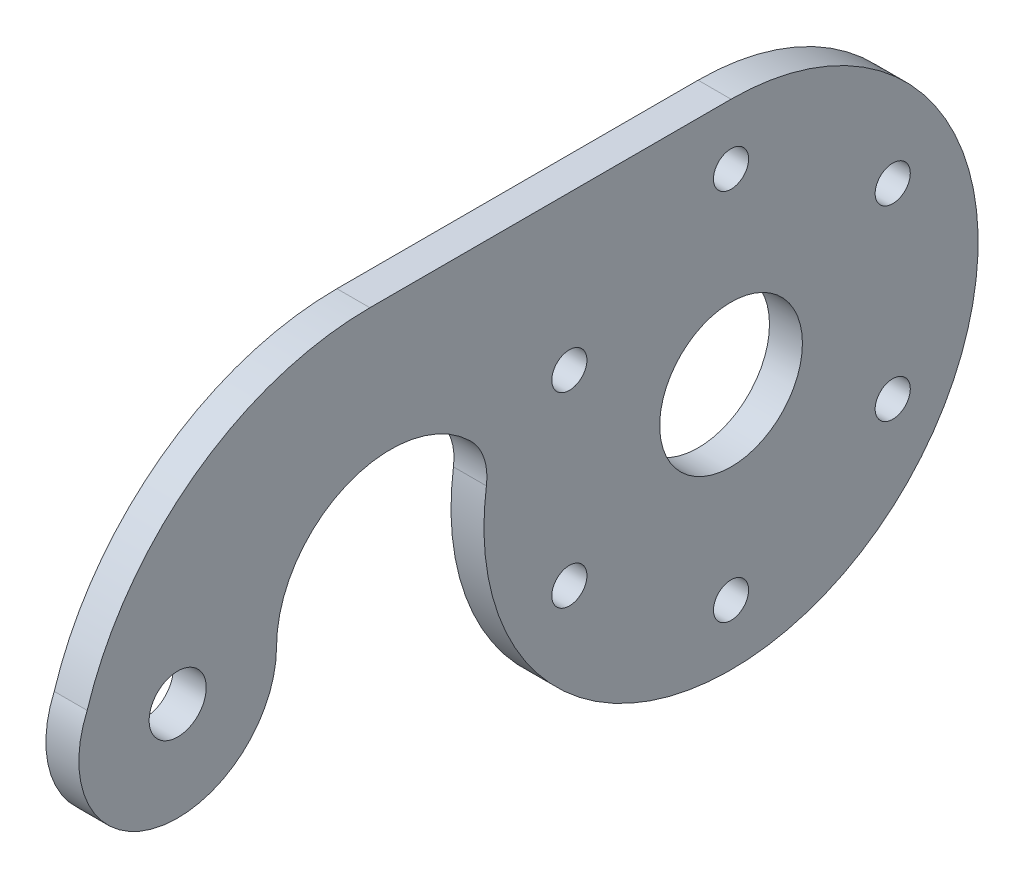
ISO-10303-21;
HEADER;
FILE_DESCRIPTION(('STEP AP214'),'2;1');
FILE_NAME('part.step','',(''),(''),'','','');
FILE_SCHEMA(('AUTOMOTIVE_DESIGN { 1 0 10303 214 1 1 1 1 }'));
ENDSEC;
DATA;
#1=APPLICATION_CONTEXT('core data for automotive mechanical design processes');
#2=APPLICATION_PROTOCOL_DEFINITION('international standard','automotive_design',2000,#1);
#3=PRODUCT_CONTEXT('',#1,'mechanical');
#4=PRODUCT('Part','Part','',(#3));
#5=PRODUCT_RELATED_PRODUCT_CATEGORY('part','',(#4));
#6=PRODUCT_DEFINITION_FORMATION('','',#4);
#7=PRODUCT_DEFINITION_CONTEXT('part definition',#1,'design');
#8=PRODUCT_DEFINITION('design','',#6,#7);
#9=PRODUCT_DEFINITION_SHAPE('','',#8);
#10=(LENGTH_UNIT() NAMED_UNIT(*) SI_UNIT(.MILLI.,.METRE.));
#11=(NAMED_UNIT(*) PLANE_ANGLE_UNIT() SI_UNIT($,.RADIAN.));
#12=(NAMED_UNIT(*) SI_UNIT($,.STERADIAN.) SOLID_ANGLE_UNIT());
#13=UNCERTAINTY_MEASURE_WITH_UNIT(LENGTH_MEASURE(1.E-05),#10,'distance_accuracy_value','');
#14=(GEOMETRIC_REPRESENTATION_CONTEXT(3) GLOBAL_UNCERTAINTY_ASSIGNED_CONTEXT((#13)) GLOBAL_UNIT_ASSIGNED_CONTEXT((#10,
#11,#12)) REPRESENTATION_CONTEXT('',''));
#15=CARTESIAN_POINT('',(0.,0.,0.));
#16=DIRECTION('',(0.,0.,1.));
#17=DIRECTION('',(1.,0.,0.));
#18=AXIS2_PLACEMENT_3D('',#15,#16,#17);
#19=CARTESIAN_POINT('',(0.,0.,0.));
#20=DIRECTION('',(1.,0.,0.));
#21=DIRECTION('',(0.,0.,-1.));
#22=AXIS2_PLACEMENT_3D('',#19,#20,#21);
#23=PLANE('',#22);
#24=CARTESIAN_POINT('',(0.,8.49999999999915,14.722431864335));
#25=DIRECTION('',(1.,0.,0.));
#26=DIRECTION('',(0.,0.,-1.));
#27=AXIS2_PLACEMENT_3D('',#24,#25,#26);
#28=CIRCLE('',#27,1.60000000000091);
#29=CARTESIAN_POINT('',(0.,8.49999999999915,13.1224318643341));
#30=VERTEX_POINT('',#29);
#31=EDGE_CURVE('E193',#30,#30,#28,.T.);
#32=ORIENTED_EDGE('',*,*,#31,.T.);
#33=EDGE_LOOP('',(#32));
#34=FACE_BOUND('',#33,.T.);
#35=CARTESIAN_POINT('',(0.,-8.50000000000084,14.722431864334));
#36=DIRECTION('',(1.,0.,0.));
#37=DIRECTION('',(0.,0.,-1.));
#38=AXIS2_PLACEMENT_3D('',#35,#36,#37);
#39=CIRCLE('',#38,1.60000000000178);
#40=CARTESIAN_POINT('',(0.,-8.50000000000084,13.1224318643322));
#41=VERTEX_POINT('',#40);
#42=EDGE_CURVE('E199',#41,#41,#39,.T.);
#43=ORIENTED_EDGE('',*,*,#42,.T.);
#44=EDGE_LOOP('',(#43));
#45=FACE_BOUND('',#44,.T.);
#46=CARTESIAN_POINT('',(0.,-17.,-1.92851244215037E-12));
#47=DIRECTION('',(1.,0.,0.));
#48=DIRECTION('',(0.,0.,-1.));
#49=AXIS2_PLACEMENT_3D('',#46,#47,#48);
#50=CIRCLE('',#49,1.60000000000196);
#51=CARTESIAN_POINT('',(0.,-17.,-1.60000000000389));
#52=VERTEX_POINT('',#51);
#53=EDGE_CURVE('E205',#52,#52,#50,.T.);
#54=ORIENTED_EDGE('',*,*,#53,.T.);
#55=EDGE_LOOP('',(#54));
#56=FACE_BOUND('',#55,.T.);
#57=CARTESIAN_POINT('',(0.,-8.49999999999916,-14.7224318643369));
#58=DIRECTION('',(1.,0.,0.));
#59=DIRECTION('',(0.,0.,-1.));
#60=AXIS2_PLACEMENT_3D('',#57,#58,#59);
#61=CIRCLE('',#60,1.60000000000122);
#62=CARTESIAN_POINT('',(0.,-8.49999999999916,-16.3224318643381));
#63=VERTEX_POINT('',#62);
#64=EDGE_CURVE('E176',#63,#63,#61,.T.);
#65=ORIENTED_EDGE('',*,*,#64,.T.);
#66=EDGE_LOOP('',(#65));
#67=FACE_BOUND('',#66,.T.);
#68=CARTESIAN_POINT('',(0.,8.50000000000084,-14.7224318643359));
#69=DIRECTION('',(1.,0.,0.));
#70=DIRECTION('',(0.,0.,-1.));
#71=AXIS2_PLACEMENT_3D('',#68,#69,#70);
#72=CIRCLE('',#71,1.60000000000026);
#73=CARTESIAN_POINT('',(0.,8.50000000000084,-16.3224318643362));
#74=VERTEX_POINT('',#73);
#75=EDGE_CURVE('E175',#74,#74,#72,.T.);
#76=ORIENTED_EDGE('',*,*,#75,.T.);
#77=EDGE_LOOP('',(#76));
#78=FACE_BOUND('',#77,.T.);
#79=CARTESIAN_POINT('',(0.,17.,0.));
#80=DIRECTION('',(1.,0.,0.));
#81=DIRECTION('',(0.,0.,-1.));
#82=AXIS2_PLACEMENT_3D('',#79,#80,#81);
#83=CIRCLE('',#82,1.6);
#84=CARTESIAN_POINT('',(0.,17.,-1.6));
#85=VERTEX_POINT('',#84);
#86=EDGE_CURVE('E182',#85,#85,#83,.T.);
#87=ORIENTED_EDGE('',*,*,#86,.T.);
#88=EDGE_LOOP('',(#87));
#89=FACE_BOUND('',#88,.T.);
#90=CARTESIAN_POINT('',(0.,0.,50.3866243253377));
#91=DIRECTION('',(1.,0.,0.));
#92=DIRECTION('',(0.,0.,-1.));
#93=AXIS2_PLACEMENT_3D('',#90,#91,#92);
#94=CIRCLE('',#93,2.6);
#95=CARTESIAN_POINT('',(0.,0.,47.7866243253377));
#96=VERTEX_POINT('',#95);
#97=EDGE_CURVE('E169',#96,#96,#94,.T.);
#98=ORIENTED_EDGE('',*,*,#97,.T.);
#99=EDGE_LOOP('',(#98));
#100=FACE_BOUND('',#99,.T.);
#101=CARTESIAN_POINT('',(0.,0.,0.));
#102=DIRECTION('',(1.,0.,0.));
#103=DIRECTION('',(0.,0.,-1.));
#104=AXIS2_PLACEMENT_3D('',#101,#102,#103);
#105=CIRCLE('',#104,6.5);
#106=CARTESIAN_POINT('',(0.,0.,-6.5));
#107=VERTEX_POINT('',#106);
#108=EDGE_CURVE('E139',#107,#107,#105,.T.);
#109=ORIENTED_EDGE('',*,*,#108,.T.);
#110=EDGE_LOOP('',(#109));
#111=FACE_BOUND('',#110,.T.);
#112=CARTESIAN_POINT('',(0.,0.,0.));
#113=DIRECTION('',(1.,0.,0.));
#114=DIRECTION('',(0.,0.,-1.));
#115=AXIS2_PLACEMENT_3D('',#112,#113,#114);
#116=CIRCLE('',#115,22.5);
#117=CARTESIAN_POINT('',(0.,3.1475756942727,22.2787514741923));
#118=VERTEX_POINT('',#117);
#119=CARTESIAN_POINT('',(0.,22.5,0.));
#120=VERTEX_POINT('',#119);
#121=EDGE_CURVE('E119',#118,#120,#116,.T.);
#122=ORIENTED_EDGE('',*,*,#121,.F.);
#123=CARTESIAN_POINT('',(0.,3.84703695966663,27.2295851351239));
#124=DIRECTION('',(1.,0.,0.));
#125=DIRECTION('',(0.,0.,-1.));
#126=AXIS2_PLACEMENT_3D('',#123,#124,#125);
#127=CIRCLE('',#126,5.);
#128=CARTESIAN_POINT('',(0.,7.41795329549767,23.7297913522711));
#129=VERTEX_POINT('',#128);
#130=EDGE_CURVE('E61',#118,#129,#127,.T.);
#131=ORIENTED_EDGE('',*,*,#130,.T.);
#132=CARTESIAN_POINT('',(0.,0.,31.));
#133=DIRECTION('',(1.,0.,0.));
#134=DIRECTION('',(0.,0.,-1.));
#135=AXIS2_PLACEMENT_3D('',#132,#133,#134);
#136=CIRCLE('',#135,10.3866243253377);
#137=CARTESIAN_POINT('',(0.,0.,41.3866243253377));
#138=VERTEX_POINT('',#137);
#139=EDGE_CURVE('E137',#129,#138,#136,.T.);
#140=ORIENTED_EDGE('',*,*,#139,.T.);
#141=CARTESIAN_POINT('',(0.,0.,50.3866243253377));
#142=DIRECTION('',(1.,0.,0.));
#143=DIRECTION('',(0.,0.,-1.));
#144=AXIS2_PLACEMENT_3D('',#141,#142,#143);
#145=CIRCLE('',#144,9.);
#146=CARTESIAN_POINT('',(0.,3.61408669201935,58.6290983096806));
#147=VERTEX_POINT('',#146);
#148=EDGE_CURVE('E146',#147,#138,#145,.T.);
#149=ORIENTED_EDGE('',*,*,#148,.F.);
#150=CARTESIAN_POINT('',(0.,-4.48711657964616,32.8866243253377));
#151=DIRECTION('',(1.,0.,0.));
#152=DIRECTION('',(0.,0.,-1.));
#153=AXIS2_PLACEMENT_3D('',#150,#151,#152);
#154=CIRCLE('',#153,26.9871165796462);
#155=CARTESIAN_POINT('',(0.,22.5,32.8866243253377));
#156=VERTEX_POINT('',#155);
#157=EDGE_CURVE('E143',#147,#156,#154,.F.);
#158=ORIENTED_EDGE('',*,*,#157,.T.);
#159=DIRECTION('',(0.,0.,1.));
#160=VECTOR('',#159,1.);
#161=CARTESIAN_POINT('',(0.,22.5,0.));
#162=LINE('',#161,#160);
#163=EDGE_CURVE('E141',#120,#156,#162,.T.);
#164=ORIENTED_EDGE('',*,*,#163,.F.);
#165=EDGE_LOOP('',(#122,#131,#140,#149,#158,#164));
#166=FACE_BOUND('',#165,.T.);
#167=ADVANCED_FACE('F53',(#34,#45,#56,#67,#78,#89,#100,#111,#166),#23,.F.);
#168=CARTESIAN_POINT('',(3.,0.,0.));
#169=DIRECTION('',(-1.,0.,0.));
#170=DIRECTION('',(0.,0.,1.));
#171=AXIS2_PLACEMENT_3D('',#168,#169,#170);
#172=CYLINDRICAL_SURFACE('',#171,22.5);
#173=CARTESIAN_POINT('',(3.,0.,0.));
#174=DIRECTION('',(1.,0.,0.));
#175=DIRECTION('',(0.,0.,-1.));
#176=AXIS2_PLACEMENT_3D('',#173,#174,#175);
#177=CIRCLE('',#176,22.5);
#178=CARTESIAN_POINT('',(3.,3.1475756942727,22.2787514741923));
#179=VERTEX_POINT('',#178);
#180=CARTESIAN_POINT('',(3.,22.5,0.));
#181=VERTEX_POINT('',#180);
#182=EDGE_CURVE('E103',#179,#181,#177,.T.);
#183=ORIENTED_EDGE('',*,*,#182,.F.);
#184=DIRECTION('',(-1.,0.,0.));
#185=VECTOR('',#184,1.);
#186=CARTESIAN_POINT('',(3.,3.1475756942727,22.2787514741923));
#187=LINE('',#186,#185);
#188=EDGE_CURVE('E123',#179,#118,#187,.T.);
#189=ORIENTED_EDGE('',*,*,#188,.T.);
#190=ORIENTED_EDGE('',*,*,#121,.T.);
#191=DIRECTION('',(-1.,0.,0.));
#192=VECTOR('',#191,1.);
#193=CARTESIAN_POINT('',(3.,22.5,0.));
#194=LINE('',#193,#192);
#195=EDGE_CURVE('E117',#181,#120,#194,.T.);
#196=ORIENTED_EDGE('',*,*,#195,.F.);
#197=EDGE_LOOP('',(#183,#189,#190,#196));
#198=FACE_BOUND('',#197,.T.);
#199=ADVANCED_FACE('F118',(#198),#172,.T.);
#200=CARTESIAN_POINT('',(3.,0.,0.));
#201=DIRECTION('',(1.,0.,0.));
#202=DIRECTION('',(0.,0.,-1.));
#203=AXIS2_PLACEMENT_3D('',#200,#201,#202);
#204=PLANE('',#203);
#205=CARTESIAN_POINT('',(3.,8.49999999999915,14.722431864335));
#206=DIRECTION('',(1.,0.,0.));
#207=DIRECTION('',(0.,0.,-1.));
#208=AXIS2_PLACEMENT_3D('',#205,#206,#207);
#209=CIRCLE('',#208,1.60000000000091);
#210=CARTESIAN_POINT('',(3.,8.49999999999915,13.1224318643341));
#211=VERTEX_POINT('',#210);
#212=EDGE_CURVE('E190',#211,#211,#209,.T.);
#213=ORIENTED_EDGE('',*,*,#212,.F.);
#214=EDGE_LOOP('',(#213));
#215=FACE_BOUND('',#214,.T.);
#216=CARTESIAN_POINT('',(3.,-8.50000000000084,14.722431864334));
#217=DIRECTION('',(1.,0.,0.));
#218=DIRECTION('',(0.,0.,-1.));
#219=AXIS2_PLACEMENT_3D('',#216,#217,#218);
#220=CIRCLE('',#219,1.60000000000178);
#221=CARTESIAN_POINT('',(3.,-8.50000000000084,13.1224318643322));
#222=VERTEX_POINT('',#221);
#223=EDGE_CURVE('E196',#222,#222,#220,.T.);
#224=ORIENTED_EDGE('',*,*,#223,.F.);
#225=EDGE_LOOP('',(#224));
#226=FACE_BOUND('',#225,.T.);
#227=CARTESIAN_POINT('',(3.,-17.,-1.92851244215037E-12));
#228=DIRECTION('',(1.,0.,0.));
#229=DIRECTION('',(0.,0.,-1.));
#230=AXIS2_PLACEMENT_3D('',#227,#228,#229);
#231=CIRCLE('',#230,1.60000000000196);
#232=CARTESIAN_POINT('',(3.,-17.,-1.60000000000389));
#233=VERTEX_POINT('',#232);
#234=EDGE_CURVE('E202',#233,#233,#231,.T.);
#235=ORIENTED_EDGE('',*,*,#234,.F.);
#236=EDGE_LOOP('',(#235));
#237=FACE_BOUND('',#236,.T.);
#238=CARTESIAN_POINT('',(3.,-8.49999999999916,-14.7224318643369));
#239=DIRECTION('',(1.,0.,0.));
#240=DIRECTION('',(0.,0.,-1.));
#241=AXIS2_PLACEMENT_3D('',#238,#239,#240);
#242=CIRCLE('',#241,1.60000000000122);
#243=CARTESIAN_POINT('',(3.,-8.49999999999916,-16.3224318643381));
#244=VERTEX_POINT('',#243);
#245=EDGE_CURVE('E208',#244,#244,#242,.T.);
#246=ORIENTED_EDGE('',*,*,#245,.F.);
#247=EDGE_LOOP('',(#246));
#248=FACE_BOUND('',#247,.T.);
#249=CARTESIAN_POINT('',(3.,8.50000000000084,-14.7224318643359));
#250=DIRECTION('',(1.,0.,0.));
#251=DIRECTION('',(0.,0.,-1.));
#252=AXIS2_PLACEMENT_3D('',#249,#250,#251);
#253=CIRCLE('',#252,1.60000000000026);
#254=CARTESIAN_POINT('',(3.,8.50000000000084,-16.3224318643362));
#255=VERTEX_POINT('',#254);
#256=EDGE_CURVE('E172',#255,#255,#253,.T.);
#257=ORIENTED_EDGE('',*,*,#256,.F.);
#258=EDGE_LOOP('',(#257));
#259=FACE_BOUND('',#258,.T.);
#260=CARTESIAN_POINT('',(3.,17.,0.));
#261=DIRECTION('',(1.,0.,0.));
#262=DIRECTION('',(0.,0.,-1.));
#263=AXIS2_PLACEMENT_3D('',#260,#261,#262);
#264=CIRCLE('',#263,1.6);
#265=CARTESIAN_POINT('',(3.,17.,-1.6));
#266=VERTEX_POINT('',#265);
#267=EDGE_CURVE('E179',#266,#266,#264,.T.);
#268=ORIENTED_EDGE('',*,*,#267,.F.);
#269=EDGE_LOOP('',(#268));
#270=FACE_BOUND('',#269,.T.);
#271=CARTESIAN_POINT('',(3.,0.,50.3866243253377));
#272=DIRECTION('',(1.,0.,0.));
#273=DIRECTION('',(0.,0.,-1.));
#274=AXIS2_PLACEMENT_3D('',#271,#272,#273);
#275=CIRCLE('',#274,2.6);
#276=CARTESIAN_POINT('',(3.,0.,47.7866243253377));
#277=VERTEX_POINT('',#276);
#278=EDGE_CURVE('E185',#277,#277,#275,.T.);
#279=ORIENTED_EDGE('',*,*,#278,.F.);
#280=EDGE_LOOP('',(#279));
#281=FACE_BOUND('',#280,.T.);
#282=CARTESIAN_POINT('',(3.,0.,0.));
#283=DIRECTION('',(1.,0.,0.));
#284=DIRECTION('',(0.,0.,-1.));
#285=AXIS2_PLACEMENT_3D('',#282,#283,#284);
#286=CIRCLE('',#285,6.5);
#287=CARTESIAN_POINT('',(3.,0.,-6.5));
#288=VERTEX_POINT('',#287);
#289=EDGE_CURVE('E166',#288,#288,#286,.T.);
#290=ORIENTED_EDGE('',*,*,#289,.F.);
#291=EDGE_LOOP('',(#290));
#292=FACE_BOUND('',#291,.T.);
#293=CARTESIAN_POINT('',(3.,0.,31.));
#294=DIRECTION('',(1.,0.,0.));
#295=DIRECTION('',(0.,0.,-1.));
#296=AXIS2_PLACEMENT_3D('',#293,#294,#295);
#297=CIRCLE('',#296,10.3866243253377);
#298=CARTESIAN_POINT('',(3.,7.41795329549767,23.7297913522711));
#299=VERTEX_POINT('',#298);
#300=CARTESIAN_POINT('',(3.,0.,41.3866243253377));
#301=VERTEX_POINT('',#300);
#302=EDGE_CURVE('E114',#299,#301,#297,.T.);
#303=ORIENTED_EDGE('',*,*,#302,.F.);
#304=CARTESIAN_POINT('',(3.,3.84703695966663,27.2295851351239));
#305=DIRECTION('',(1.,0.,0.));
#306=DIRECTION('',(0.,0.,-1.));
#307=AXIS2_PLACEMENT_3D('',#304,#305,#306);
#308=CIRCLE('',#307,5.);
#309=EDGE_CURVE('E12',#299,#179,#308,.F.);
#310=ORIENTED_EDGE('',*,*,#309,.T.);
#311=ORIENTED_EDGE('',*,*,#182,.T.);
#312=DIRECTION('',(0.,0.,1.));
#313=VECTOR('',#312,1.);
#314=CARTESIAN_POINT('',(3.,22.5,0.));
#315=LINE('',#314,#313);
#316=CARTESIAN_POINT('',(3.,22.5,32.8866243253377));
#317=VERTEX_POINT('',#316);
#318=EDGE_CURVE('E108',#181,#317,#315,.T.);
#319=ORIENTED_EDGE('',*,*,#318,.T.);
#320=CARTESIAN_POINT('',(3.,-4.48711657964616,32.8866243253377));
#321=DIRECTION('',(1.,0.,0.));
#322=DIRECTION('',(0.,0.,-1.));
#323=AXIS2_PLACEMENT_3D('',#320,#321,#322);
#324=CIRCLE('',#323,26.9871165796462);
#325=CARTESIAN_POINT('',(3.,3.61408669201935,58.6290983096806));
#326=VERTEX_POINT('',#325);
#327=EDGE_CURVE('E128',#326,#317,#324,.F.);
#328=ORIENTED_EDGE('',*,*,#327,.F.);
#329=CARTESIAN_POINT('',(3.,0.,50.3866243253377));
#330=DIRECTION('',(1.,0.,0.));
#331=DIRECTION('',(0.,0.,-1.));
#332=AXIS2_PLACEMENT_3D('',#329,#330,#331);
#333=CIRCLE('',#332,9.);
#334=EDGE_CURVE('E130',#326,#301,#333,.T.);
#335=ORIENTED_EDGE('',*,*,#334,.T.);
#336=EDGE_LOOP('',(#303,#310,#311,#319,#328,#335));
#337=FACE_BOUND('',#336,.T.);
#338=ADVANCED_FACE('F105',(#215,#226,#237,#248,#259,#270,#281,#292,#337),#204,.T.);
#339=CARTESIAN_POINT('',(3.,22.5,0.));
#340=DIRECTION('',(0.,-1.,0.));
#341=DIRECTION('',(0.,0.,-1.));
#342=AXIS2_PLACEMENT_3D('',#339,#340,#341);
#343=PLANE('',#342);
#344=ORIENTED_EDGE('',*,*,#163,.T.);
#345=DIRECTION('',(-1.,0.,0.));
#346=VECTOR('',#345,1.);
#347=CARTESIAN_POINT('',(3.,22.5,32.8866243253377));
#348=LINE('',#347,#346);
#349=EDGE_CURVE('E124',#317,#156,#348,.T.);
#350=ORIENTED_EDGE('',*,*,#349,.F.);
#351=ORIENTED_EDGE('',*,*,#318,.F.);
#352=ORIENTED_EDGE('',*,*,#195,.T.);
#353=EDGE_LOOP('',(#344,#350,#351,#352));
#354=FACE_BOUND('',#353,.T.);
#355=ADVANCED_FACE('F126',(#354),#343,.F.);
#356=CARTESIAN_POINT('',(3.,-4.48711657964616,32.8866243253377));
#357=DIRECTION('',(-1.,0.,0.));
#358=DIRECTION('',(0.,0.,1.));
#359=AXIS2_PLACEMENT_3D('',#356,#357,#358);
#360=CYLINDRICAL_SURFACE('',#359,26.9871165796462);
#361=ORIENTED_EDGE('',*,*,#157,.F.);
#362=DIRECTION('',(-1.,0.,0.));
#363=VECTOR('',#362,1.);
#364=CARTESIAN_POINT('',(3.,3.61408669201935,58.6290983096806));
#365=LINE('',#364,#363);
#366=EDGE_CURVE('E151',#326,#147,#365,.T.);
#367=ORIENTED_EDGE('',*,*,#366,.F.);
#368=ORIENTED_EDGE('',*,*,#327,.T.);
#369=ORIENTED_EDGE('',*,*,#349,.T.);
#370=EDGE_LOOP('',(#361,#367,#368,#369));
#371=FACE_BOUND('',#370,.T.);
#372=ADVANCED_FACE('F159',(#371),#360,.T.);
#373=CARTESIAN_POINT('',(3.,0.,50.3866243253377));
#374=DIRECTION('',(-1.,0.,0.));
#375=DIRECTION('',(0.,0.,1.));
#376=AXIS2_PLACEMENT_3D('',#373,#374,#375);
#377=CYLINDRICAL_SURFACE('',#376,9.);
#378=ORIENTED_EDGE('',*,*,#148,.T.);
#379=DIRECTION('',(-1.,0.,0.));
#380=VECTOR('',#379,1.);
#381=CARTESIAN_POINT('',(3.,0.,41.3866243253377));
#382=LINE('',#381,#380);
#383=EDGE_CURVE('E136',#301,#138,#382,.T.);
#384=ORIENTED_EDGE('',*,*,#383,.F.);
#385=ORIENTED_EDGE('',*,*,#334,.F.);
#386=ORIENTED_EDGE('',*,*,#366,.T.);
#387=EDGE_LOOP('',(#378,#384,#385,#386));
#388=FACE_BOUND('',#387,.T.);
#389=ADVANCED_FACE('F163',(#388),#377,.T.);
#390=CARTESIAN_POINT('',(3.,0.,31.));
#391=DIRECTION('',(-1.,0.,0.));
#392=DIRECTION('',(0.,0.,1.));
#393=AXIS2_PLACEMENT_3D('',#390,#391,#392);
#394=CYLINDRICAL_SURFACE('',#393,10.3866243253377);
#395=ORIENTED_EDGE('',*,*,#139,.F.);
#396=DIRECTION('',(-1.,0.,0.));
#397=VECTOR('',#396,1.);
#398=CARTESIAN_POINT('',(3.,7.41795329549767,23.7297913522711));
#399=LINE('',#398,#397);
#400=EDGE_CURVE('E68',#129,#299,#399,.F.);
#401=ORIENTED_EDGE('',*,*,#400,.T.);
#402=ORIENTED_EDGE('',*,*,#302,.T.);
#403=ORIENTED_EDGE('',*,*,#383,.T.);
#404=EDGE_LOOP('',(#395,#401,#402,#403));
#405=FACE_BOUND('',#404,.T.);
#406=ADVANCED_FACE('F164',(#405),#394,.F.);
#407=CARTESIAN_POINT('',(3.,3.84703695966663,27.2295851351239));
#408=DIRECTION('',(-1.,0.,0.));
#409=DIRECTION('',(0.,0.,1.));
#410=AXIS2_PLACEMENT_3D('',#407,#408,#409);
#411=CYLINDRICAL_SURFACE('',#410,5.);
#412=ORIENTED_EDGE('',*,*,#309,.F.);
#413=ORIENTED_EDGE('',*,*,#400,.F.);
#414=ORIENTED_EDGE('',*,*,#130,.F.);
#415=ORIENTED_EDGE('',*,*,#188,.F.);
#416=EDGE_LOOP('',(#412,#413,#414,#415));
#417=FACE_BOUND('',#416,.T.);
#418=ADVANCED_FACE('F55',(#417),#411,.F.);
#419=CARTESIAN_POINT('',(0.,0.,0.));
#420=DIRECTION('',(1.,0.,0.));
#421=DIRECTION('',(0.,0.,-1.));
#422=AXIS2_PLACEMENT_3D('',#419,#420,#421);
#423=CYLINDRICAL_SURFACE('',#422,6.5);
#424=ORIENTED_EDGE('',*,*,#108,.F.);
#425=EDGE_LOOP('',(#424));
#426=FACE_BOUND('',#425,.T.);
#427=ORIENTED_EDGE('',*,*,#289,.T.);
#428=EDGE_LOOP('',(#427));
#429=FACE_BOUND('',#428,.T.);
#430=ADVANCED_FACE('F236',(#426,#429),#423,.F.);
#431=CARTESIAN_POINT('',(0.,0.,50.3866243253377));
#432=DIRECTION('',(1.,0.,0.));
#433=DIRECTION('',(0.,0.,-1.));
#434=AXIS2_PLACEMENT_3D('',#431,#432,#433);
#435=CYLINDRICAL_SURFACE('',#434,2.6);
#436=ORIENTED_EDGE('',*,*,#97,.F.);
#437=EDGE_LOOP('',(#436));
#438=FACE_BOUND('',#437,.T.);
#439=ORIENTED_EDGE('',*,*,#278,.T.);
#440=EDGE_LOOP('',(#439));
#441=FACE_BOUND('',#440,.T.);
#442=ADVANCED_FACE('F238',(#438,#441),#435,.F.);
#443=CARTESIAN_POINT('',(0.,17.,0.));
#444=DIRECTION('',(1.,0.,0.));
#445=DIRECTION('',(0.,0.,-1.));
#446=AXIS2_PLACEMENT_3D('',#443,#444,#445);
#447=CYLINDRICAL_SURFACE('',#446,1.6);
#448=ORIENTED_EDGE('',*,*,#86,.F.);
#449=EDGE_LOOP('',(#448));
#450=FACE_BOUND('',#449,.T.);
#451=ORIENTED_EDGE('',*,*,#267,.T.);
#452=EDGE_LOOP('',(#451));
#453=FACE_BOUND('',#452,.T.);
#454=ADVANCED_FACE('F245',(#450,#453),#447,.F.);
#455=CARTESIAN_POINT('',(0.,8.50000000000084,-14.7224318643359));
#456=DIRECTION('',(1.,0.,0.));
#457=DIRECTION('',(0.,0.,-1.));
#458=AXIS2_PLACEMENT_3D('',#455,#456,#457);
#459=CYLINDRICAL_SURFACE('',#458,1.60000000000026);
#460=ORIENTED_EDGE('',*,*,#75,.F.);
#461=EDGE_LOOP('',(#460));
#462=FACE_BOUND('',#461,.T.);
#463=ORIENTED_EDGE('',*,*,#256,.T.);
#464=EDGE_LOOP('',(#463));
#465=FACE_BOUND('',#464,.T.);
#466=ADVANCED_FACE('F220',(#462,#465),#459,.F.);
#467=CARTESIAN_POINT('',(0.,-8.49999999999916,-14.7224318643369));
#468=DIRECTION('',(1.,0.,0.));
#469=DIRECTION('',(0.,0.,-1.));
#470=AXIS2_PLACEMENT_3D('',#467,#468,#469);
#471=CYLINDRICAL_SURFACE('',#470,1.60000000000122);
#472=ORIENTED_EDGE('',*,*,#64,.F.);
#473=EDGE_LOOP('',(#472));
#474=FACE_BOUND('',#473,.T.);
#475=ORIENTED_EDGE('',*,*,#245,.T.);
#476=EDGE_LOOP('',(#475));
#477=FACE_BOUND('',#476,.T.);
#478=ADVANCED_FACE('F216',(#474,#477),#471,.F.);
#479=CARTESIAN_POINT('',(0.,-17.,-1.92851244215037E-12));
#480=DIRECTION('',(1.,0.,0.));
#481=DIRECTION('',(0.,0.,-1.));
#482=AXIS2_PLACEMENT_3D('',#479,#480,#481);
#483=CYLINDRICAL_SURFACE('',#482,1.60000000000196);
#484=ORIENTED_EDGE('',*,*,#53,.F.);
#485=EDGE_LOOP('',(#484));
#486=FACE_BOUND('',#485,.T.);
#487=ORIENTED_EDGE('',*,*,#234,.T.);
#488=EDGE_LOOP('',(#487));
#489=FACE_BOUND('',#488,.T.);
#490=ADVANCED_FACE('F219',(#486,#489),#483,.F.);
#491=CARTESIAN_POINT('',(0.,-8.50000000000084,14.722431864334));
#492=DIRECTION('',(1.,0.,0.));
#493=DIRECTION('',(0.,0.,-1.));
#494=AXIS2_PLACEMENT_3D('',#491,#492,#493);
#495=CYLINDRICAL_SURFACE('',#494,1.60000000000178);
#496=ORIENTED_EDGE('',*,*,#42,.F.);
#497=EDGE_LOOP('',(#496));
#498=FACE_BOUND('',#497,.T.);
#499=ORIENTED_EDGE('',*,*,#223,.T.);
#500=EDGE_LOOP('',(#499));
#501=FACE_BOUND('',#500,.T.);
#502=ADVANCED_FACE('F324',(#498,#501),#495,.F.);
#503=CARTESIAN_POINT('',(0.,8.49999999999915,14.722431864335));
#504=DIRECTION('',(1.,0.,0.));
#505=DIRECTION('',(0.,0.,-1.));
#506=AXIS2_PLACEMENT_3D('',#503,#504,#505);
#507=CYLINDRICAL_SURFACE('',#506,1.60000000000091);
#508=ORIENTED_EDGE('',*,*,#31,.F.);
#509=EDGE_LOOP('',(#508));
#510=FACE_BOUND('',#509,.T.);
#511=ORIENTED_EDGE('',*,*,#212,.T.);
#512=EDGE_LOOP('',(#511));
#513=FACE_BOUND('',#512,.T.);
#514=ADVANCED_FACE('F334',(#510,#513),#507,.F.);
#515=CLOSED_SHELL('',(#167,#199,#338,#355,#372,#389,#406,#418,#430,#442,#454,#466,#478,#490,
#502,#514));
#516=MANIFOLD_SOLID_BREP('B2',#515);
#517=ADVANCED_BREP_SHAPE_REPRESENTATION('',(#18,#516),#14);
#518=SHAPE_DEFINITION_REPRESENTATION(#9,#517);
ENDSEC;
END-ISO-10303-21;
